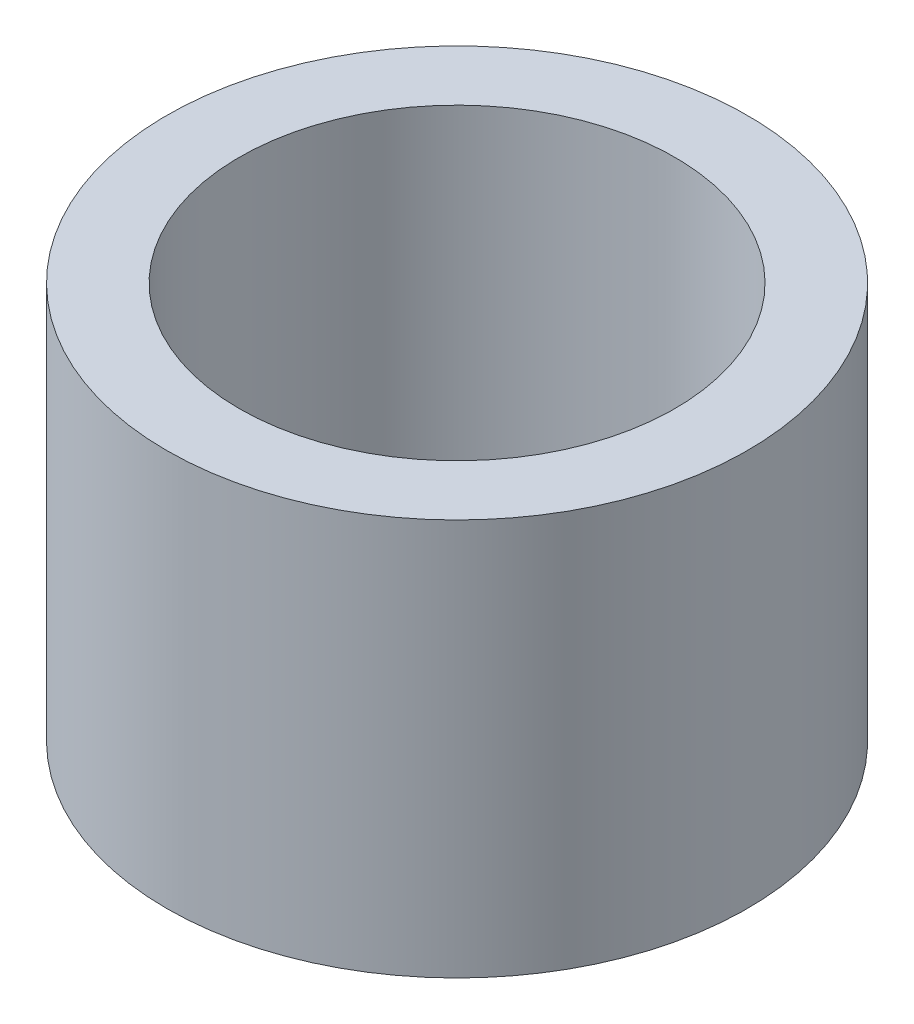
ISO-10303-21;
HEADER;
FILE_DESCRIPTION(('STEP AP214'),'2;1');
FILE_NAME('part.step','',(''),(''),'','','');
FILE_SCHEMA(('AUTOMOTIVE_DESIGN { 1 0 10303 214 1 1 1 1 }'));
ENDSEC;
DATA;
#1=APPLICATION_CONTEXT('core data for automotive mechanical design processes');
#2=APPLICATION_PROTOCOL_DEFINITION('international standard','automotive_design',2000,#1);
#3=PRODUCT_CONTEXT('',#1,'mechanical');
#4=PRODUCT('Part','Part','',(#3));
#5=PRODUCT_RELATED_PRODUCT_CATEGORY('part','',(#4));
#6=PRODUCT_DEFINITION_FORMATION('','',#4);
#7=PRODUCT_DEFINITION_CONTEXT('part definition',#1,'design');
#8=PRODUCT_DEFINITION('design','',#6,#7);
#9=PRODUCT_DEFINITION_SHAPE('','',#8);
#10=(LENGTH_UNIT() NAMED_UNIT(*) SI_UNIT(.MILLI.,.METRE.));
#11=(NAMED_UNIT(*) PLANE_ANGLE_UNIT() SI_UNIT($,.RADIAN.));
#12=(NAMED_UNIT(*) SI_UNIT($,.STERADIAN.) SOLID_ANGLE_UNIT());
#13=UNCERTAINTY_MEASURE_WITH_UNIT(LENGTH_MEASURE(1.E-05),#10,'distance_accuracy_value','');
#14=(GEOMETRIC_REPRESENTATION_CONTEXT(3) GLOBAL_UNCERTAINTY_ASSIGNED_CONTEXT((#13)) GLOBAL_UNIT_ASSIGNED_CONTEXT((#10,
#11,#12)) REPRESENTATION_CONTEXT('',''));
#15=CARTESIAN_POINT('',(0.,0.,0.));
#16=DIRECTION('',(0.,0.,1.));
#17=DIRECTION('',(1.,0.,0.));
#18=AXIS2_PLACEMENT_3D('',#15,#16,#17);
#19=CARTESIAN_POINT('',(0.,34.1586699250134,0.));
#20=DIRECTION('',(0.,-1.,0.));
#21=DIRECTION('',(0.,0.,-1.));
#22=AXIS2_PLACEMENT_3D('',#19,#20,#21);
#23=CYLINDRICAL_SURFACE('',#22,25.);
#24=CARTESIAN_POINT('',(0.,34.1586699250134,0.));
#25=DIRECTION('',(0.,1.,0.));
#26=DIRECTION('',(0.,0.,1.));
#27=AXIS2_PLACEMENT_3D('',#24,#25,#26);
#28=CIRCLE('',#27,25.);
#29=CARTESIAN_POINT('',(0.,34.1586699250134,25.));
#30=VERTEX_POINT('',#29);
#31=EDGE_CURVE('E10',#30,#30,#28,.T.);
#32=ORIENTED_EDGE('',*,*,#31,.F.);
#33=EDGE_LOOP('',(#32));
#34=FACE_BOUND('',#33,.T.);
#35=CARTESIAN_POINT('',(0.,0.,0.));
#36=DIRECTION('',(0.,1.,0.));
#37=DIRECTION('',(0.,0.,1.));
#38=AXIS2_PLACEMENT_3D('',#35,#36,#37);
#39=CIRCLE('',#38,25.);
#40=CARTESIAN_POINT('',(0.,0.,25.));
#41=VERTEX_POINT('',#40);
#42=EDGE_CURVE('E37',#41,#41,#39,.T.);
#43=ORIENTED_EDGE('',*,*,#42,.T.);
#44=EDGE_LOOP('',(#43));
#45=FACE_BOUND('',#44,.T.);
#46=ADVANCED_FACE('F40',(#34,#45),#23,.T.);
#47=CARTESIAN_POINT('',(0.,34.1586699250134,0.));
#48=DIRECTION('',(0.,1.,0.));
#49=DIRECTION('',(0.,0.,1.));
#50=AXIS2_PLACEMENT_3D('',#47,#48,#49);
#51=PLANE('',#50);
#52=CARTESIAN_POINT('',(0.,34.1586699250134,0.));
#53=DIRECTION('',(0.,1.,0.));
#54=DIRECTION('',(0.,0.,1.));
#55=AXIS2_PLACEMENT_3D('',#52,#53,#54);
#56=CIRCLE('',#55,18.7549094758248);
#57=CARTESIAN_POINT('',(0.,34.1586699250134,18.7549094758248));
#58=VERTEX_POINT('',#57);
#59=EDGE_CURVE('E50',#58,#58,#56,.T.);
#60=ORIENTED_EDGE('',*,*,#59,.F.);
#61=EDGE_LOOP('',(#60));
#62=FACE_BOUND('',#61,.T.);
#63=ORIENTED_EDGE('',*,*,#31,.T.);
#64=EDGE_LOOP('',(#63));
#65=FACE_BOUND('',#64,.T.);
#66=ADVANCED_FACE('F59',(#62,#65),#51,.T.);
#67=CARTESIAN_POINT('',(0.,0.,0.));
#68=DIRECTION('',(0.,1.,0.));
#69=DIRECTION('',(0.,0.,1.));
#70=AXIS2_PLACEMENT_3D('',#67,#68,#69);
#71=PLANE('',#70);
#72=CARTESIAN_POINT('',(0.,0.,0.));
#73=DIRECTION('',(0.,1.,0.));
#74=DIRECTION('',(0.,0.,1.));
#75=AXIS2_PLACEMENT_3D('',#72,#73,#74);
#76=CIRCLE('',#75,18.7549094758248);
#77=CARTESIAN_POINT('',(0.,0.,18.7549094758248));
#78=VERTEX_POINT('',#77);
#79=EDGE_CURVE('E47',#78,#78,#76,.T.);
#80=ORIENTED_EDGE('',*,*,#79,.T.);
#81=EDGE_LOOP('',(#80));
#82=FACE_BOUND('',#81,.T.);
#83=ORIENTED_EDGE('',*,*,#42,.F.);
#84=EDGE_LOOP('',(#83));
#85=FACE_BOUND('',#84,.T.);
#86=ADVANCED_FACE('F58',(#82,#85),#71,.F.);
#87=CARTESIAN_POINT('',(0.,34.1586699250134,0.));
#88=DIRECTION('',(0.,-1.,0.));
#89=DIRECTION('',(0.,0.,-1.));
#90=AXIS2_PLACEMENT_3D('',#87,#88,#89);
#91=CYLINDRICAL_SURFACE('',#90,18.7549094758248);
#92=ORIENTED_EDGE('',*,*,#59,.T.);
#93=EDGE_LOOP('',(#92));
#94=FACE_BOUND('',#93,.T.);
#95=ORIENTED_EDGE('',*,*,#79,.F.);
#96=EDGE_LOOP('',(#95));
#97=FACE_BOUND('',#96,.T.);
#98=ADVANCED_FACE('F54',(#94,#97),#91,.F.);
#99=CLOSED_SHELL('',(#46,#66,#86,#98));
#100=MANIFOLD_SOLID_BREP('B2',#99);
#101=ADVANCED_BREP_SHAPE_REPRESENTATION('',(#18,#100),#14);
#102=SHAPE_DEFINITION_REPRESENTATION(#9,#101);
ENDSEC;
END-ISO-10303-21;
